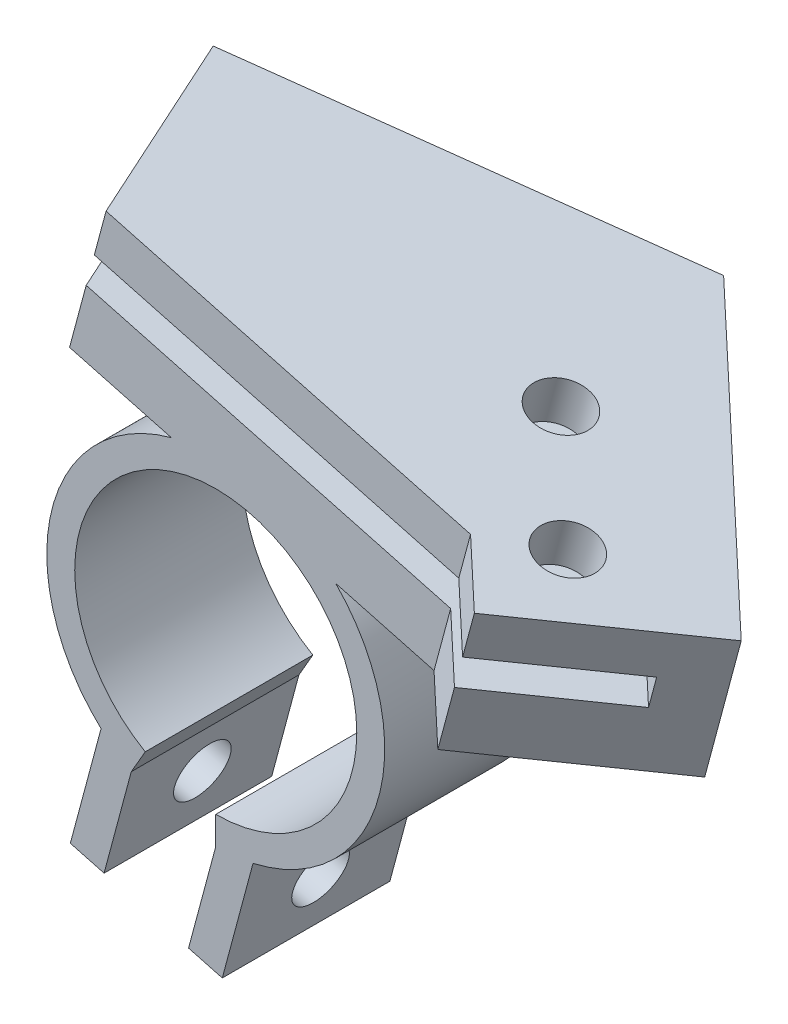
ISO-10303-21;
HEADER;
FILE_DESCRIPTION(('STEP AP214'),'2;1');
FILE_NAME('part.step','',(''),(''),'','','');
FILE_SCHEMA(('AUTOMOTIVE_DESIGN { 1 0 10303 214 1 1 1 1 }'));
ENDSEC;
DATA;
#1=APPLICATION_CONTEXT('core data for automotive mechanical design processes');
#2=APPLICATION_PROTOCOL_DEFINITION('international standard','automotive_design',2000,#1);
#3=PRODUCT_CONTEXT('',#1,'mechanical');
#4=PRODUCT('Part','Part','',(#3));
#5=PRODUCT_RELATED_PRODUCT_CATEGORY('part','',(#4));
#6=PRODUCT_DEFINITION_FORMATION('','',#4);
#7=PRODUCT_DEFINITION_CONTEXT('part definition',#1,'design');
#8=PRODUCT_DEFINITION('design','',#6,#7);
#9=PRODUCT_DEFINITION_SHAPE('','',#8);
#10=(LENGTH_UNIT() NAMED_UNIT(*) SI_UNIT(.MILLI.,.METRE.));
#11=(NAMED_UNIT(*) PLANE_ANGLE_UNIT() SI_UNIT($,.RADIAN.));
#12=(NAMED_UNIT(*) SI_UNIT($,.STERADIAN.) SOLID_ANGLE_UNIT());
#13=UNCERTAINTY_MEASURE_WITH_UNIT(LENGTH_MEASURE(1.E-05),#10,'distance_accuracy_value','');
#14=(GEOMETRIC_REPRESENTATION_CONTEXT(3) GLOBAL_UNCERTAINTY_ASSIGNED_CONTEXT((#13)) GLOBAL_UNIT_ASSIGNED_CONTEXT((#10,
#11,#12)) REPRESENTATION_CONTEXT('',''));
#15=CARTESIAN_POINT('',(0.,0.,0.));
#16=DIRECTION('',(0.,0.,1.));
#17=DIRECTION('',(1.,0.,0.));
#18=AXIS2_PLACEMENT_3D('',#15,#16,#17);
#19=CARTESIAN_POINT('',(0.,0.,0.));
#20=DIRECTION('',(0.,0.,-1.));
#21=DIRECTION('',(1.,0.,0.));
#22=AXIS2_PLACEMENT_3D('',#19,#20,#21);
#23=PLANE('',#22);
#24=DIRECTION('',(0.965925826289069,-0.258819045102519,0.));
#25=VECTOR('',#24,1.);
#26=CARTESIAN_POINT('',(8.95474809949023,33.4195748762786,0.));
#27=LINE('',#26,#25);
#28=CARTESIAN_POINT('',(-17.386622384415,40.4777238249699,0.));
#29=VERTEX_POINT('',#28);
#30=CARTESIAN_POINT('',(34.8002931997711,26.4942819387162,0.));
#31=VERTEX_POINT('',#30);
#32=EDGE_CURVE('E237',#29,#31,#27,.T.);
#33=ORIENTED_EDGE('',*,*,#32,.T.);
#34=DIRECTION('',(-0.258819045102519,-0.965925826289069,0.));
#35=VECTOR('',#34,1.);
#36=CARTESIAN_POINT('',(36.4826169929375,32.7727998095951,0.));
#37=LINE('',#36,#35);
#38=CARTESIAN_POINT('',(36.4826169929375,32.7727998095951,0.));
#39=VERTEX_POINT('',#38);
#40=EDGE_CURVE('E316',#39,#31,#37,.T.);
#41=ORIENTED_EDGE('',*,*,#40,.F.);
#42=DIRECTION('',(0.965925826289069,-0.258819045102519,0.));
#43=VECTOR('',#42,1.);
#44=CARTESIAN_POINT('',(10.6370718926566,39.6980927471575,0.));
#45=LINE('',#44,#43);
#46=CARTESIAN_POINT('',(-15.7042985912486,46.7562416958489,0.));
#47=VERTEX_POINT('',#46);
#48=EDGE_CURVE('E287',#47,#39,#45,.T.);
#49=ORIENTED_EDGE('',*,*,#48,.F.);
#50=DIRECTION('',(-0.258819045102519,-0.965925826289069,0.));
#51=VECTOR('',#50,1.);
#52=CARTESIAN_POINT('',(-15.7042985912486,46.7562416958489,0.));
#53=LINE('',#52,#51);
#54=EDGE_CURVE('E320',#47,#29,#53,.T.);
#55=ORIENTED_EDGE('',*,*,#54,.T.);
#56=EDGE_LOOP('',(#33,#41,#49,#55));
#57=FACE_BOUND('',#56,.T.);
#58=ADVANCED_FACE('F39',(#57),#23,.F.);
#59=CARTESIAN_POINT('',(-11.8964203484179,45.7359237958064,9.5898541144352));
#60=DIRECTION('',(0.893385391656228,-0.239381894224047,-0.380208956618535));
#61=DIRECTION('',(0.391594370746934,0.,0.920137950961329));
#62=AXIS2_PLACEMENT_3D('',#59,#60,#61);
#63=PLANE('',#62);
#64=DIRECTION('',(-0.367253650584263,0.098405319091434,-0.924900615908026));
#65=VECTOR('',#64,1.);
#66=CARTESIAN_POINT('',(-13.5787441415843,39.4574059249274,9.5898541144352));
#67=LINE('',#66,#65);
#68=CARTESIAN_POINT('',(-24.7316953961002,42.4458302067986,-18.4980123181606));
#69=VERTEX_POINT('',#68);
#70=EDGE_CURVE('E235',#29,#69,#67,.T.);
#71=ORIENTED_EDGE('',*,*,#70,.F.);
#72=ORIENTED_EDGE('',*,*,#54,.F.);
#73=DIRECTION('',(-0.367253650584263,0.098405319091434,-0.924900615908026));
#74=VECTOR('',#73,1.);
#75=CARTESIAN_POINT('',(-11.8964203484179,45.7359237958064,9.5898541144352));
#76=LINE('',#75,#74);
#77=CARTESIAN_POINT('',(-25.8037739823159,49.4623879708633,-25.4347669374709));
#78=VERTEX_POINT('',#77);
#79=EDGE_CURVE('E284',#47,#78,#76,.T.);
#80=ORIENTED_EDGE('',*,*,#79,.T.);
#81=DIRECTION('',(-0.258819045102519,-0.965925826289069,0.));
#82=VECTOR('',#81,1.);
#83=CARTESIAN_POINT('',(-25.8037739823159,49.4623879708633,-25.4347669374709));
#84=LINE('',#83,#82);
#85=CARTESIAN_POINT('',(-31.0319186933868,29.9506862798241,-25.4347669374709));
#86=VERTEX_POINT('',#85);
#87=EDGE_CURVE('E306',#78,#86,#84,.T.);
#88=ORIENTED_EDGE('',*,*,#87,.T.);
#89=DIRECTION('',(-0.367253650584263,0.098405319091434,-0.924900615908026));
#90=VECTOR('',#89,1.);
#91=CARTESIAN_POINT('',(-17.1245650594888,26.2242221047672,9.58985411443521));
#92=LINE('',#91,#90);
#93=CARTESIAN_POINT('',(-20.9324433023195,27.2445400048097,0.));
#94=VERTEX_POINT('',#93);
#95=EDGE_CURVE('E261',#94,#86,#92,.T.);
#96=ORIENTED_EDGE('',*,*,#95,.F.);
#97=CARTESIAN_POINT('',(-18.5513080873763,36.1310576066691,0.));
#98=VERTEX_POINT('',#97);
#99=EDGE_CURVE('E305',#98,#94,#53,.T.);
#100=ORIENTED_EDGE('',*,*,#99,.F.);
#101=DIRECTION('',(-0.367253650584263,0.098405319091434,-0.924900615908026));
#102=VECTOR('',#101,1.);
#103=CARTESIAN_POINT('',(-14.7434298445456,35.1107397066266,9.5898541144352));
#104=LINE('',#103,#102);
#105=CARTESIAN_POINT('',(-25.8963810990616,38.0991639884978,-18.4980123181606));
#106=VERTEX_POINT('',#105);
#107=EDGE_CURVE('E252',#98,#106,#104,.T.);
#108=ORIENTED_EDGE('',*,*,#107,.T.);
#109=DIRECTION('',(-0.258819045102519,-0.965925826289069,0.));
#110=VECTOR('',#109,1.);
#111=CARTESIAN_POINT('',(-24.7316953961002,42.4458302067986,-18.4980123181606));
#112=LINE('',#111,#110);
#113=EDGE_CURVE('E258',#69,#106,#112,.T.);
#114=ORIENTED_EDGE('',*,*,#113,.F.);
#115=EDGE_LOOP('',(#71,#72,#80,#88,#96,#100,#108,#114));
#116=FACE_BOUND('',#115,.T.);
#117=ADVANCED_FACE('F464',(#116),#63,.F.);
#118=CARTESIAN_POINT('',(32.852385511905,33.7455174032758,20.691346675466));
#119=DIRECTION('',(-0.718087161401695,0.19241087499274,-0.668826497542213));
#120=DIRECTION('',(0.681561853761521,0.,-0.731760506926384));
#121=AXIS2_PLACEMENT_3D('',#118,#119,#120);
#122=PLANE('',#121);
#123=DIRECTION('',(-0.646036787282486,0.173105035433139,0.743418533657465));
#124=VECTOR('',#123,1.);
#125=CARTESIAN_POINT('',(31.1700617187387,27.4669995323969,20.691346675466));
#126=LINE('',#125,#124);
#127=CARTESIAN_POINT('',(55.6522563056765,20.9070152638853,-7.48122423508143));
#128=VERTEX_POINT('',#127);
#129=CARTESIAN_POINT('',(42.7315205600268,24.369115972548,7.38714643806784));
#130=VERTEX_POINT('',#129);
#131=EDGE_CURVE('E206',#128,#130,#126,.T.);
#132=ORIENTED_EDGE('',*,*,#131,.F.);
#133=DIRECTION('',(-0.258819045102519,-0.965925826289069,0.));
#134=VECTOR('',#133,1.);
#135=CARTESIAN_POINT('',(55.6522563056765,20.9070152638853,-7.48122423508143));
#136=LINE('',#135,#134);
#137=CARTESIAN_POINT('',(54.4875706027152,16.5603490455845,-7.48122423508142));
#138=VERTEX_POINT('',#137);
#139=EDGE_CURVE('E214',#128,#138,#136,.T.);
#140=ORIENTED_EDGE('',*,*,#139,.T.);
#141=DIRECTION('',(-0.646036787282486,0.173105035433139,0.743418533657465));
#142=VECTOR('',#141,1.);
#143=CARTESIAN_POINT('',(30.0053760157773,23.1203333140961,20.691346675466));
#144=LINE('',#143,#142);
#145=CARTESIAN_POINT('',(41.5668348570655,20.0224497542472,7.38714643806785));
#146=VERTEX_POINT('',#145);
#147=EDGE_CURVE('E247',#138,#146,#144,.T.);
#148=ORIENTED_EDGE('',*,*,#147,.T.);
#149=DIRECTION('',(-0.258819045102519,-0.965925826289069,0.));
#150=VECTOR('',#149,1.);
#151=CARTESIAN_POINT('',(44.4138443531932,30.647633843427,7.38714643806784));
#152=LINE('',#151,#150);
#153=CARTESIAN_POINT('',(39.1856996421223,11.1359321523878,7.38714643806785));
#154=VERTEX_POINT('',#153);
#155=EDGE_CURVE('E315',#146,#154,#152,.T.);
#156=ORIENTED_EDGE('',*,*,#155,.T.);
#157=DIRECTION('',(-0.646036787282486,0.173105035433139,0.743418533657465));
#158=VECTOR('',#157,1.);
#159=CARTESIAN_POINT('',(27.6242408008341,14.2338157122366,20.691346675466));
#160=LINE('',#159,#158);
#161=CARTESIAN_POINT('',(56.9517112923908,6.37554367797645,-13.0568632375122));
#162=VERTEX_POINT('',#161);
#163=EDGE_CURVE('E270',#162,#154,#160,.T.);
#164=ORIENTED_EDGE('',*,*,#163,.F.);
#165=DIRECTION('',(-0.258819045102519,-0.965925826289069,0.));
#166=VECTOR('',#165,1.);
#167=CARTESIAN_POINT('',(62.1798560034617,25.8872453690156,-13.0568632375122));
#168=LINE('',#167,#166);
#169=CARTESIAN_POINT('',(62.1798560034617,25.8872453690156,-13.0568632375122));
#170=VERTEX_POINT('',#169);
#171=EDGE_CURVE('E311',#170,#162,#168,.T.);
#172=ORIENTED_EDGE('',*,*,#171,.F.);
#173=DIRECTION('',(-0.646036787282486,0.173105035433139,0.743418533657465));
#174=VECTOR('',#173,1.);
#175=CARTESIAN_POINT('',(32.852385511905,33.7455174032758,20.691346675466));
#176=LINE('',#175,#174);
#177=CARTESIAN_POINT('',(44.4138443531932,30.647633843427,7.38714643806784));
#178=VERTEX_POINT('',#177);
#179=EDGE_CURVE('E292',#170,#178,#176,.T.);
#180=ORIENTED_EDGE('',*,*,#179,.T.);
#181=EDGE_CURVE('E226',#178,#130,#152,.T.);
#182=ORIENTED_EDGE('',*,*,#181,.T.);
#183=EDGE_LOOP('',(#132,#140,#148,#156,#164,#172,#180,#182));
#184=FACE_BOUND('',#183,.T.);
#185=ADVANCED_FACE('F223',(#184),#122,.F.);
#186=CARTESIAN_POINT('',(22.1985307339448,36.6002091873087,-13.3042002373981));
#187=DIRECTION('',(-0.646036787282486,0.173105035433139,0.743418533657465));
#188=DIRECTION('',(-0.754813677044907,0.,-0.655939260104125));
#189=AXIS2_PLACEMENT_3D('',#186,#187,#188);
#190=PLANE('',#189);
#191=ORIENTED_EDGE('',*,*,#181,.F.);
#192=DIRECTION('',(0.718087161401695,-0.19241087499274,0.668826497542213));
#193=VECTOR('',#192,1.);
#194=CARTESIAN_POINT('',(22.1985307339448,36.6002091873087,-13.3042002373981));
#195=LINE('',#194,#193);
#196=EDGE_CURVE('E290',#39,#178,#195,.T.);
#197=ORIENTED_EDGE('',*,*,#196,.F.);
#198=ORIENTED_EDGE('',*,*,#40,.T.);
#199=DIRECTION('',(0.718087161401695,-0.19241087499274,0.668826497542213));
#200=VECTOR('',#199,1.);
#201=CARTESIAN_POINT('',(20.5162069407784,30.3216913164297,-13.3042002373981));
#202=LINE('',#201,#200);
#203=EDGE_CURVE('E220',#31,#130,#202,.T.);
#204=ORIENTED_EDGE('',*,*,#203,.T.);
#205=EDGE_LOOP('',(#191,#197,#198,#204));
#206=FACE_BOUND('',#205,.T.);
#207=ADVANCED_FACE('F618',(#206),#190,.T.);
#208=CARTESIAN_POINT('',(29.0892210288191,34.7538542875041,-20.3375832009133));
#209=DIRECTION('',(-0.258819045102519,-0.965925826289069,0.));
#210=DIRECTION('',(0.965925826289069,-0.258819045102519,0.));
#211=AXIS2_PLACEMENT_3D('',#208,#209,#210);
#212=CYLINDRICAL_SURFACE('',#211,4.);
#213=CARTESIAN_POINT('',(29.0892210288191,34.7538542875041,-20.3375832009133));
#214=DIRECTION('',(0.258819045102519,0.965925826289069,0.));
#215=DIRECTION('',(0.965925826289069,-0.258819045102519,0.));
#216=AXIS2_PLACEMENT_3D('',#213,#214,#215);
#217=CIRCLE('',#216,4.);
#218=CARTESIAN_POINT('',(32.9529243339754,33.718578107094,-20.3375832009133));
#219=VERTEX_POINT('',#218);
#220=EDGE_CURVE('E299',#219,#219,#217,.T.);
#221=ORIENTED_EDGE('',*,*,#220,.T.);
#222=EDGE_LOOP('',(#221));
#223=FACE_BOUND('',#222,.T.);
#224=CARTESIAN_POINT('',(27.4068972356528,28.4753364166251,-20.3375832009133));
#225=DIRECTION('',(0.258819045102519,0.965925826289069,0.));
#226=DIRECTION('',(0.965925826289069,-0.258819045102519,0.));
#227=AXIS2_PLACEMENT_3D('',#224,#225,#226);
#228=CIRCLE('',#227,4.);
#229=CARTESIAN_POINT('',(31.270600540809,27.4400602362151,-20.3375832009133));
#230=VERTEX_POINT('',#229);
#231=EDGE_CURVE('E230',#230,#230,#228,.T.);
#232=ORIENTED_EDGE('',*,*,#231,.F.);
#233=EDGE_LOOP('',(#232));
#234=FACE_BOUND('',#233,.T.);
#235=ADVANCED_FACE('F629',(#223,#234),#212,.F.);
#236=CARTESIAN_POINT('',(43.4509642568531,30.9056367876493,-6.96105325006903));
#237=DIRECTION('',(-0.258819045102519,-0.965925826289069,0.));
#238=DIRECTION('',(0.965925826289069,-0.258819045102519,0.));
#239=AXIS2_PLACEMENT_3D('',#236,#237,#238);
#240=CYLINDRICAL_SURFACE('',#239,4.00000000000001);
#241=CARTESIAN_POINT('',(43.4509642568531,30.9056367876493,-6.96105325006903));
#242=DIRECTION('',(0.258819045102519,0.965925826289069,0.));
#243=DIRECTION('',(0.965925826289069,-0.258819045102519,0.));
#244=AXIS2_PLACEMENT_3D('',#241,#242,#243);
#245=CIRCLE('',#244,4.00000000000001);
#246=CARTESIAN_POINT('',(47.3146675620093,29.8703606072392,-6.96105325006903));
#247=VERTEX_POINT('',#246);
#248=EDGE_CURVE('E302',#247,#247,#245,.T.);
#249=ORIENTED_EDGE('',*,*,#248,.T.);
#250=EDGE_LOOP('',(#249));
#251=FACE_BOUND('',#250,.T.);
#252=CARTESIAN_POINT('',(41.7686404636867,24.6271189167704,-6.96105325006903));
#253=DIRECTION('',(0.258819045102519,0.965925826289069,0.));
#254=DIRECTION('',(0.965925826289069,-0.258819045102519,0.));
#255=AXIS2_PLACEMENT_3D('',#252,#253,#254);
#256=CIRCLE('',#255,4.00000000000001);
#257=CARTESIAN_POINT('',(45.632343768843,23.5918427363603,-6.96105325006903));
#258=VERTEX_POINT('',#257);
#259=EDGE_CURVE('E227',#258,#258,#256,.T.);
#260=ORIENTED_EDGE('',*,*,#259,.F.);
#261=EDGE_LOOP('',(#260));
#262=FACE_BOUND('',#261,.T.);
#263=ADVANCED_FACE('F640',(#251,#262),#240,.F.);
#264=CARTESIAN_POINT('',(0.,0.,-24.));
#265=DIRECTION('',(0.,0.,1.));
#266=DIRECTION('',(-1.,0.,0.));
#267=AXIS2_PLACEMENT_3D('',#264,#265,#266);
#268=CYLINDRICAL_SURFACE('',#267,24.193);
#269=CARTESIAN_POINT('',(0.,0.,-24.));
#270=DIRECTION('',(0.,0.,1.));
#271=DIRECTION('',(1.,0.,0.));
#272=AXIS2_PLACEMENT_3D('',#269,#270,#271);
#273=CIRCLE('',#272,24.193);
#274=CARTESIAN_POINT('',(-6.36405527316415,23.3409521973743,-24.));
#275=VERTEX_POINT('',#274);
#276=CARTESIAN_POINT('',(-16.419734670584,-17.7677675116381,-24.));
#277=VERTEX_POINT('',#276);
#278=EDGE_CURVE('E411',#275,#277,#273,.T.);
#279=ORIENTED_EDGE('',*,*,#278,.T.);
#280=DIRECTION('',(0.,0.,-1.));
#281=VECTOR('',#280,1.);
#282=CARTESIAN_POINT('',(-16.419734670584,-17.7677675116381,0.));
#283=LINE('',#282,#281);
#284=CARTESIAN_POINT('',(-16.419734670584,-17.7677675116381,0.));
#285=VERTEX_POINT('',#284);
#286=EDGE_CURVE('E379',#285,#277,#283,.T.);
#287=ORIENTED_EDGE('',*,*,#286,.F.);
#288=CARTESIAN_POINT('',(0.,0.,0.));
#289=DIRECTION('',(0.,0.,1.));
#290=DIRECTION('',(1.,0.,0.));
#291=AXIS2_PLACEMENT_3D('',#288,#289,#290);
#292=CIRCLE('',#291,24.193);
#293=CARTESIAN_POINT('',(-6.36405527316413,23.3409521973743,0.));
#294=VERTEX_POINT('',#293);
#295=EDGE_CURVE('E405',#294,#285,#292,.T.);
#296=ORIENTED_EDGE('',*,*,#295,.F.);
#297=DIRECTION('',(0.,0.,1.));
#298=VECTOR('',#297,1.);
#299=CARTESIAN_POINT('',(-6.36405527316415,23.3409521973743,-24.));
#300=LINE('',#299,#298);
#301=EDGE_CURVE('E326',#275,#294,#300,.T.);
#302=ORIENTED_EDGE('',*,*,#301,.F.);
#303=EDGE_LOOP('',(#279,#287,#296,#302));
#304=FACE_BOUND('',#303,.T.);
#305=ADVANCED_FACE('F471',(#304),#268,.T.);
#306=CARTESIAN_POINT('',(5.3360235923067,-23.5972053689064,0.));
#307=VERTEX_POINT('',#306);
#308=CARTESIAN_POINT('',(17.1819096363356,17.0318299148623,0.));
#309=VERTEX_POINT('',#308);
#310=EDGE_CURVE('E412',#307,#309,#292,.T.);
#311=ORIENTED_EDGE('',*,*,#310,.F.);
#312=DIRECTION('',(0.,0.,-1.));
#313=VECTOR('',#312,1.);
#314=CARTESIAN_POINT('',(5.3360235923067,-23.5972053689064,0.));
#315=LINE('',#314,#313);
#316=CARTESIAN_POINT('',(5.3360235923067,-23.5972053689064,-24.));
#317=VERTEX_POINT('',#316);
#318=EDGE_CURVE('E356',#307,#317,#315,.T.);
#319=ORIENTED_EDGE('',*,*,#318,.T.);
#320=CARTESIAN_POINT('',(17.1819096363356,17.0318299148623,-24.));
#321=VERTEX_POINT('',#320);
#322=EDGE_CURVE('E408',#317,#321,#273,.T.);
#323=ORIENTED_EDGE('',*,*,#322,.T.);
#324=DIRECTION('',(0.,0.,1.));
#325=VECTOR('',#324,1.);
#326=CARTESIAN_POINT('',(17.1819096363356,17.0318299148623,-24.));
#327=LINE('',#326,#325);
#328=EDGE_CURVE('E324',#309,#321,#327,.F.);
#329=ORIENTED_EDGE('',*,*,#328,.F.);
#330=EDGE_LOOP('',(#311,#319,#323,#329));
#331=FACE_BOUND('',#330,.T.);
#332=ADVANCED_FACE('F41',(#331),#268,.T.);
#333=CARTESIAN_POINT('',(0.,0.,-24.));
#334=DIRECTION('',(0.,0.,-1.));
#335=DIRECTION('',(1.,0.,0.));
#336=AXIS2_PLACEMENT_3D('',#333,#334,#335);
#337=PLANE('',#336);
#338=DIRECTION('',(0.965925826289069,-0.258819045102519,0.));
#339=VECTOR('',#338,1.);
#340=CARTESIAN_POINT('',(5.40892718158571,20.1863910561183,-24.));
#341=LINE('',#340,#339);
#342=EDGE_CURVE('E63',#275,#321,#341,.T.);
#343=ORIENTED_EDGE('',*,*,#342,.T.);
#344=ORIENTED_EDGE('',*,*,#322,.F.);
#345=DIRECTION('',(-0.258819045102521,-0.965925826289068,0.));
#346=VECTOR('',#345,1.);
#347=CARTESIAN_POINT('',(10.8778791314454,-2.91471892863415,-24.));
#348=LINE('',#347,#346);
#349=CARTESIAN_POINT('',(0.93609982556388,-40.0179444158206,-24.));
#350=VERTEX_POINT('',#349);
#351=EDGE_CURVE('E342',#317,#350,#348,.T.);
#352=ORIENTED_EDGE('',*,*,#351,.T.);
#353=DIRECTION('',(-0.965925826289068,0.258819045102521,0.));
#354=VECTOR('',#353,1.);
#355=CARTESIAN_POINT('',(-9.94177930588146,-37.1032254871864,-24.));
#356=LINE('',#355,#354);
#357=CARTESIAN_POINT('',(-3.89352930588146,-38.723849190308,-24.));
#358=VERTEX_POINT('',#357);
#359=EDGE_CURVE('E351',#350,#358,#356,.T.);
#360=ORIENTED_EDGE('',*,*,#359,.T.);
#361=DIRECTION('',(0.258819045102521,0.965925826289068,0.));
#362=VECTOR('',#361,1.);
#363=CARTESIAN_POINT('',(6.04825000000001,-1.62062370312154,-24.));
#364=LINE('',#363,#362);
#365=CARTESIAN_POINT('',(0.,-24.193,-24.));
#366=VERTEX_POINT('',#365);
#367=EDGE_CURVE('E337',#358,#366,#364,.T.);
#368=ORIENTED_EDGE('',*,*,#367,.T.);
#369=DIRECTION('',(0.,1.,0.));
#370=VECTOR('',#369,1.);
#371=CARTESIAN_POINT('',(0.,-24.193,-24.));
#372=LINE('',#371,#370);
#373=CARTESIAN_POINT('',(0.,-20.193,-24.));
#374=VERTEX_POINT('',#373);
#375=EDGE_CURVE('E382',#366,#374,#372,.T.);
#376=ORIENTED_EDGE('',*,*,#375,.T.);
#377=CARTESIAN_POINT('',(0.,0.,-24.));
#378=DIRECTION('',(0.,0.,1.));
#379=DIRECTION('',(1.,0.,0.));
#380=AXIS2_PLACEMENT_3D('',#377,#378,#379);
#381=CIRCLE('',#380,20.193);
#382=CARTESIAN_POINT('',(-10.0965,-17.4876509786192,-24.));
#383=VERTEX_POINT('',#382);
#384=EDGE_CURVE('E402',#374,#383,#381,.T.);
#385=ORIENTED_EDGE('',*,*,#384,.T.);
#386=DIRECTION('',(-0.500000000000001,-0.866025403784438,0.));
#387=VECTOR('',#386,1.);
#388=CARTESIAN_POINT('',(-12.0965,-20.9517525937569,-24.));
#389=LINE('',#388,#387);
#390=CARTESIAN_POINT('',(-12.0965,-20.9517525937569,-24.));
#391=VERTEX_POINT('',#390);
#392=EDGE_CURVE('E390',#383,#391,#389,.T.);
#393=ORIENTED_EDGE('',*,*,#392,.T.);
#394=DIRECTION('',(-0.258819045102521,-0.965925826289068,0.));
#395=VECTOR('',#394,1.);
#396=CARTESIAN_POINT('',(-6.04825000000001,1.62062370312154,-24.));
#397=LINE('',#396,#395);
#398=CARTESIAN_POINT('',(-15.9900293058815,-35.4826017840649,-24.));
#399=VERTEX_POINT('',#398);
#400=EDGE_CURVE('E366',#391,#399,#397,.T.);
#401=ORIENTED_EDGE('',*,*,#400,.T.);
#402=DIRECTION('',(-0.965925826289068,0.258819045102521,0.));
#403=VECTOR('',#402,1.);
#404=CARTESIAN_POINT('',(-9.94177930588146,-37.1032254871864,-24.));
#405=LINE('',#404,#403);
#406=CARTESIAN_POINT('',(-20.8196584373268,-34.1885065585523,-24.));
#407=VERTEX_POINT('',#406);
#408=EDGE_CURVE('E374',#399,#407,#405,.T.);
#409=ORIENTED_EDGE('',*,*,#408,.T.);
#410=DIRECTION('',(0.258819045102521,0.965925826289068,0.));
#411=VECTOR('',#410,1.);
#412=CARTESIAN_POINT('',(-10.8778791314454,2.91471892863415,-24.));
#413=LINE('',#412,#411);
#414=EDGE_CURVE('E359',#407,#277,#413,.T.);
#415=ORIENTED_EDGE('',*,*,#414,.T.);
#416=ORIENTED_EDGE('',*,*,#278,.F.);
#417=EDGE_LOOP('',(#343,#344,#352,#360,#368,#376,#385,#393,#401,#409,#415,#416));
#418=FACE_BOUND('',#417,.T.);
#419=ADVANCED_FACE('F435',(#418),#337,.T.);
#420=ORIENTED_EDGE('',*,*,#99,.T.);
#421=DIRECTION('',(0.965925826289069,-0.258819045102519,0.));
#422=VECTOR('',#421,1.);
#423=CARTESIAN_POINT('',(5.40892718158571,20.1863910561183,0.));
#424=LINE('',#423,#422);
#425=EDGE_CURVE('E266',#94,#294,#424,.T.);
#426=ORIENTED_EDGE('',*,*,#425,.T.);
#427=ORIENTED_EDGE('',*,*,#295,.T.);
#428=DIRECTION('',(0.258819045102521,0.965925826289068,0.));
#429=VECTOR('',#428,1.);
#430=CARTESIAN_POINT('',(-10.8778791314454,2.91471892863415,0.));
#431=LINE('',#430,#429);
#432=CARTESIAN_POINT('',(-20.8196584373268,-34.1885065585523,0.));
#433=VERTEX_POINT('',#432);
#434=EDGE_CURVE('E363',#433,#285,#431,.T.);
#435=ORIENTED_EDGE('',*,*,#434,.F.);
#436=DIRECTION('',(-0.965925826289068,0.258819045102521,0.));
#437=VECTOR('',#436,1.);
#438=CARTESIAN_POINT('',(-9.94177930588146,-37.1032254871864,0.));
#439=LINE('',#438,#437);
#440=CARTESIAN_POINT('',(-15.9900293058815,-35.4826017840649,0.));
#441=VERTEX_POINT('',#440);
#442=EDGE_CURVE('E365',#441,#433,#439,.T.);
#443=ORIENTED_EDGE('',*,*,#442,.F.);
#444=DIRECTION('',(-0.258819045102521,-0.965925826289068,0.));
#445=VECTOR('',#444,1.);
#446=CARTESIAN_POINT('',(-6.04825000000001,1.62062370312154,0.));
#447=LINE('',#446,#445);
#448=CARTESIAN_POINT('',(-12.0965,-20.9517525937569,0.));
#449=VERTEX_POINT('',#448);
#450=EDGE_CURVE('E369',#449,#441,#447,.T.);
#451=ORIENTED_EDGE('',*,*,#450,.F.);
#452=DIRECTION('',(-0.500000000000001,-0.866025403784438,0.));
#453=VECTOR('',#452,1.);
#454=CARTESIAN_POINT('',(-12.0965,-20.9517525937569,0.));
#455=LINE('',#454,#453);
#456=CARTESIAN_POINT('',(-10.0965,-17.4876509786192,0.));
#457=VERTEX_POINT('',#456);
#458=EDGE_CURVE('E389',#457,#449,#455,.T.);
#459=ORIENTED_EDGE('',*,*,#458,.F.);
#460=CARTESIAN_POINT('',(0.,0.,0.));
#461=DIRECTION('',(0.,0.,1.));
#462=DIRECTION('',(1.,0.,0.));
#463=AXIS2_PLACEMENT_3D('',#460,#461,#462);
#464=CIRCLE('',#463,20.193);
#465=CARTESIAN_POINT('',(0.,-20.193,0.));
#466=VERTEX_POINT('',#465);
#467=EDGE_CURVE('E400',#466,#457,#464,.T.);
#468=ORIENTED_EDGE('',*,*,#467,.F.);
#469=DIRECTION('',(0.,1.,0.));
#470=VECTOR('',#469,1.);
#471=CARTESIAN_POINT('',(0.,-24.193,0.));
#472=LINE('',#471,#470);
#473=CARTESIAN_POINT('',(0.,-24.193,0.));
#474=VERTEX_POINT('',#473);
#475=EDGE_CURVE('E386',#474,#466,#472,.T.);
#476=ORIENTED_EDGE('',*,*,#475,.F.);
#477=DIRECTION('',(0.258819045102521,0.965925826289068,0.));
#478=VECTOR('',#477,1.);
#479=CARTESIAN_POINT('',(6.04825000000001,-1.62062370312154,0.));
#480=LINE('',#479,#478);
#481=CARTESIAN_POINT('',(-3.89352930588146,-38.723849190308,0.));
#482=VERTEX_POINT('',#481);
#483=EDGE_CURVE('E338',#482,#474,#480,.T.);
#484=ORIENTED_EDGE('',*,*,#483,.F.);
#485=DIRECTION('',(-0.965925826289068,0.258819045102521,0.));
#486=VECTOR('',#485,1.);
#487=CARTESIAN_POINT('',(-9.94177930588146,-37.1032254871864,0.));
#488=LINE('',#487,#486);
#489=CARTESIAN_POINT('',(0.93609982556388,-40.0179444158206,0.));
#490=VERTEX_POINT('',#489);
#491=EDGE_CURVE('E341',#490,#482,#488,.T.);
#492=ORIENTED_EDGE('',*,*,#491,.F.);
#493=DIRECTION('',(-0.258819045102521,-0.965925826289068,0.));
#494=VECTOR('',#493,1.);
#495=CARTESIAN_POINT('',(10.8778791314454,-2.91471892863415,0.));
#496=LINE('',#495,#494);
#497=EDGE_CURVE('E345',#307,#490,#496,.T.);
#498=ORIENTED_EDGE('',*,*,#497,.F.);
#499=ORIENTED_EDGE('',*,*,#310,.T.);
#500=CARTESIAN_POINT('',(31.2544722818666,13.2610981185559,0.));
#501=VERTEX_POINT('',#500);
#502=EDGE_CURVE('E265',#309,#501,#424,.T.);
#503=ORIENTED_EDGE('',*,*,#502,.T.);
#504=CARTESIAN_POINT('',(33.6356074968098,22.1476157204154,0.));
#505=VERTEX_POINT('',#504);
#506=EDGE_CURVE('E319',#505,#501,#37,.T.);
#507=ORIENTED_EDGE('',*,*,#506,.F.);
#508=DIRECTION('',(0.965925826289069,-0.258819045102519,0.));
#509=VECTOR('',#508,1.);
#510=CARTESIAN_POINT('',(7.79006239652889,29.0729086579777,0.));
#511=LINE('',#510,#509);
#512=EDGE_CURVE('E255',#98,#505,#511,.T.);
#513=ORIENTED_EDGE('',*,*,#512,.F.);
#514=EDGE_LOOP('',(#420,#426,#427,#435,#443,#451,#459,#468,#476,#484,#492,#498,#499,#503,#507,#513));
#515=FACE_BOUND('',#514,.T.);
#516=ADVANCED_FACE('F427',(#515),#23,.F.);
#517=CARTESIAN_POINT('',(0.,0.,-24.));
#518=DIRECTION('',(0.,0.,1.));
#519=DIRECTION('',(-1.,0.,0.));
#520=AXIS2_PLACEMENT_3D('',#517,#518,#519);
#521=CYLINDRICAL_SURFACE('',#520,20.193);
#522=DIRECTION('',(0.,0.,1.));
#523=VECTOR('',#522,1.);
#524=CARTESIAN_POINT('',(-10.0965,-17.4876509786192,-24.));
#525=LINE('',#524,#523);
#526=EDGE_CURVE('E11',#457,#383,#525,.F.);
#527=ORIENTED_EDGE('',*,*,#526,.T.);
#528=ORIENTED_EDGE('',*,*,#384,.F.);
#529=DIRECTION('',(0.,0.,1.));
#530=VECTOR('',#529,1.);
#531=CARTESIAN_POINT('',(0.,-20.193,-24.));
#532=LINE('',#531,#530);
#533=EDGE_CURVE('E48',#374,#466,#532,.T.);
#534=ORIENTED_EDGE('',*,*,#533,.T.);
#535=ORIENTED_EDGE('',*,*,#467,.T.);
#536=EDGE_LOOP('',(#527,#528,#534,#535));
#537=FACE_BOUND('',#536,.T.);
#538=ADVANCED_FACE('F417',(#537),#521,.F.);
#539=CARTESIAN_POINT('',(0.,-24.193,0.));
#540=DIRECTION('',(1.,0.,0.));
#541=DIRECTION('',(0.,0.,1.));
#542=AXIS2_PLACEMENT_3D('',#539,#540,#541);
#543=PLANE('',#542);
#544=ORIENTED_EDGE('',*,*,#533,.F.);
#545=ORIENTED_EDGE('',*,*,#375,.F.);
#546=DIRECTION('',(0.,0.,-1.));
#547=VECTOR('',#546,1.);
#548=CARTESIAN_POINT('',(0.,-24.193,0.));
#549=LINE('',#548,#547);
#550=EDGE_CURVE('E393',#474,#366,#549,.T.);
#551=ORIENTED_EDGE('',*,*,#550,.F.);
#552=ORIENTED_EDGE('',*,*,#475,.T.);
#553=EDGE_LOOP('',(#544,#545,#551,#552));
#554=FACE_BOUND('',#553,.T.);
#555=ADVANCED_FACE('F423',(#554),#543,.F.);
#556=CARTESIAN_POINT('',(-12.0965,-20.9517525937569,0.));
#557=DIRECTION('',(-0.866025403784438,0.500000000000001,0.));
#558=DIRECTION('',(-0.500000000000001,-0.866025403784438,0.));
#559=AXIS2_PLACEMENT_3D('',#556,#557,#558);
#560=PLANE('',#559);
#561=ORIENTED_EDGE('',*,*,#526,.F.);
#562=ORIENTED_EDGE('',*,*,#458,.T.);
#563=DIRECTION('',(0.,0.,-1.));
#564=VECTOR('',#563,1.);
#565=CARTESIAN_POINT('',(-12.0965,-20.9517525937569,0.));
#566=LINE('',#565,#564);
#567=EDGE_CURVE('E398',#449,#391,#566,.T.);
#568=ORIENTED_EDGE('',*,*,#567,.T.);
#569=ORIENTED_EDGE('',*,*,#392,.F.);
#570=EDGE_LOOP('',(#561,#562,#568,#569));
#571=FACE_BOUND('',#570,.T.);
#572=ADVANCED_FACE('F431',(#571),#560,.F.);
#573=CARTESIAN_POINT('',(-10.8778791314454,2.91471892863415,0.));
#574=DIRECTION('',(0.965925826289068,-0.258819045102521,0.));
#575=DIRECTION('',(0.258819045102521,0.965925826289068,0.));
#576=AXIS2_PLACEMENT_3D('',#573,#574,#575);
#577=PLANE('',#576);
#578=CARTESIAN_POINT('',(-18.7491060765067,-26.4610999482397,-12.));
#579=DIRECTION('',(0.965925826289068,-0.258819045102521,0.));
#580=DIRECTION('',(-0.258819045102521,-0.965925826289068,0.));
#581=AXIS2_PLACEMENT_3D('',#578,#579,#580);
#582=CIRCLE('',#581,4.);
#583=CARTESIAN_POINT('',(-19.7843822569167,-30.324803253396,-12.));
#584=VERTEX_POINT('',#583);
#585=EDGE_CURVE('E328',#584,#584,#582,.T.);
#586=ORIENTED_EDGE('',*,*,#585,.T.);
#587=EDGE_LOOP('',(#586));
#588=FACE_BOUND('',#587,.T.);
#589=ORIENTED_EDGE('',*,*,#414,.F.);
#590=DIRECTION('',(0.,0.,-1.));
#591=VECTOR('',#590,1.);
#592=CARTESIAN_POINT('',(-20.8196584373268,-34.1885065585523,0.));
#593=LINE('',#592,#591);
#594=EDGE_CURVE('E372',#433,#407,#593,.T.);
#595=ORIENTED_EDGE('',*,*,#594,.F.);
#596=ORIENTED_EDGE('',*,*,#434,.T.);
#597=ORIENTED_EDGE('',*,*,#286,.T.);
#598=EDGE_LOOP('',(#589,#595,#596,#597));
#599=FACE_BOUND('',#598,.T.);
#600=ADVANCED_FACE('F475',(#588,#599),#577,.F.);
#601=CARTESIAN_POINT('',(-6.04825000000001,1.62062370312154,0.));
#602=DIRECTION('',(-0.965925826289068,0.258819045102521,0.));
#603=DIRECTION('',(-0.258819045102521,-0.965925826289068,0.));
#604=AXIS2_PLACEMENT_3D('',#601,#602,#603);
#605=PLANE('',#604);
#606=CARTESIAN_POINT('',(-13.9194769450613,-27.7551951737523,-12.));
#607=DIRECTION('',(0.965925826289068,-0.258819045102521,0.));
#608=DIRECTION('',(-0.258819045102521,-0.965925826289068,0.));
#609=AXIS2_PLACEMENT_3D('',#606,#607,#608);
#610=CIRCLE('',#609,4.);
#611=CARTESIAN_POINT('',(-14.9547531254714,-31.6188984789086,-12.));
#612=VERTEX_POINT('',#611);
#613=EDGE_CURVE('E334',#612,#612,#610,.T.);
#614=ORIENTED_EDGE('',*,*,#613,.F.);
#615=EDGE_LOOP('',(#614));
#616=FACE_BOUND('',#615,.T.);
#617=ORIENTED_EDGE('',*,*,#400,.F.);
#618=ORIENTED_EDGE('',*,*,#567,.F.);
#619=ORIENTED_EDGE('',*,*,#450,.T.);
#620=DIRECTION('',(0.,0.,-1.));
#621=VECTOR('',#620,1.);
#622=CARTESIAN_POINT('',(-15.9900293058815,-35.4826017840649,0.));
#623=LINE('',#622,#621);
#624=EDGE_CURVE('E383',#441,#399,#623,.T.);
#625=ORIENTED_EDGE('',*,*,#624,.T.);
#626=EDGE_LOOP('',(#617,#618,#619,#625));
#627=FACE_BOUND('',#626,.T.);
#628=ADVANCED_FACE('F480',(#616,#627),#605,.F.);
#629=CARTESIAN_POINT('',(-9.94177930588146,-37.1032254871864,0.));
#630=DIRECTION('',(0.258819045102521,0.965925826289068,0.));
#631=DIRECTION('',(-0.965925826289068,0.258819045102521,0.));
#632=AXIS2_PLACEMENT_3D('',#629,#630,#631);
#633=PLANE('',#632);
#634=ORIENTED_EDGE('',*,*,#408,.F.);
#635=ORIENTED_EDGE('',*,*,#624,.F.);
#636=ORIENTED_EDGE('',*,*,#442,.T.);
#637=ORIENTED_EDGE('',*,*,#594,.T.);
#638=EDGE_LOOP('',(#634,#635,#636,#637));
#639=FACE_BOUND('',#638,.T.);
#640=ADVANCED_FACE('F478',(#639),#633,.F.);
#641=CARTESIAN_POINT('',(6.04825000000001,-1.62062370312154,0.));
#642=DIRECTION('',(0.965925826289068,-0.258819045102521,0.));
#643=DIRECTION('',(0.258819045102521,0.965925826289068,0.));
#644=AXIS2_PLACEMENT_3D('',#641,#642,#643);
#645=PLANE('',#644);
#646=CARTESIAN_POINT('',(-1.82297694506129,-30.9964425799954,-12.));
#647=DIRECTION('',(-0.965925826289068,0.258819045102521,0.));
#648=DIRECTION('',(0.258819045102521,0.965925826289068,0.));
#649=AXIS2_PLACEMENT_3D('',#646,#647,#648);
#650=CIRCLE('',#649,4.);
#651=CARTESIAN_POINT('',(-0.78770076465121,-27.1327392748392,-12.));
#652=VERTEX_POINT('',#651);
#653=EDGE_CURVE('E331',#652,#652,#650,.T.);
#654=ORIENTED_EDGE('',*,*,#653,.F.);
#655=EDGE_LOOP('',(#654));
#656=FACE_BOUND('',#655,.T.);
#657=ORIENTED_EDGE('',*,*,#367,.F.);
#658=DIRECTION('',(0.,0.,-1.));
#659=VECTOR('',#658,1.);
#660=CARTESIAN_POINT('',(-3.89352930588146,-38.723849190308,0.));
#661=LINE('',#660,#659);
#662=EDGE_CURVE('E348',#482,#358,#661,.T.);
#663=ORIENTED_EDGE('',*,*,#662,.F.);
#664=ORIENTED_EDGE('',*,*,#483,.T.);
#665=ORIENTED_EDGE('',*,*,#550,.T.);
#666=EDGE_LOOP('',(#657,#663,#664,#665));
#667=FACE_BOUND('',#666,.T.);
#668=ADVANCED_FACE('F439',(#656,#667),#645,.F.);
#669=CARTESIAN_POINT('',(10.8778791314454,-2.91471892863415,0.));
#670=DIRECTION('',(-0.965925826289068,0.258819045102521,0.));
#671=DIRECTION('',(-0.258819045102521,-0.965925826289068,0.));
#672=AXIS2_PLACEMENT_3D('',#669,#670,#671);
#673=PLANE('',#672);
#674=CARTESIAN_POINT('',(3.00665218638405,-32.290537805508,-12.));
#675=DIRECTION('',(0.965925826289068,-0.258819045102521,0.));
#676=DIRECTION('',(-0.258819045102521,-0.965925826289068,0.));
#677=AXIS2_PLACEMENT_3D('',#674,#675,#676);
#678=CIRCLE('',#677,4.);
#679=CARTESIAN_POINT('',(1.97137600597396,-36.1542411106643,-12.));
#680=VERTEX_POINT('',#679);
#681=EDGE_CURVE('E43',#680,#680,#678,.T.);
#682=ORIENTED_EDGE('',*,*,#681,.F.);
#683=EDGE_LOOP('',(#682));
#684=FACE_BOUND('',#683,.T.);
#685=ORIENTED_EDGE('',*,*,#351,.F.);
#686=ORIENTED_EDGE('',*,*,#318,.F.);
#687=ORIENTED_EDGE('',*,*,#497,.T.);
#688=DIRECTION('',(0.,0.,-1.));
#689=VECTOR('',#688,1.);
#690=CARTESIAN_POINT('',(0.93609982556388,-40.0179444158206,0.));
#691=LINE('',#690,#689);
#692=EDGE_CURVE('E360',#490,#350,#691,.T.);
#693=ORIENTED_EDGE('',*,*,#692,.T.);
#694=EDGE_LOOP('',(#685,#686,#687,#693));
#695=FACE_BOUND('',#694,.T.);
#696=ADVANCED_FACE('F445',(#684,#695),#673,.F.);
#697=CARTESIAN_POINT('',(-9.94177930588146,-37.1032254871864,0.));
#698=DIRECTION('',(0.258819045102521,0.965925826289068,0.));
#699=DIRECTION('',(-0.965925826289068,0.258819045102521,0.));
#700=AXIS2_PLACEMENT_3D('',#697,#698,#699);
#701=PLANE('',#700);
#702=ORIENTED_EDGE('',*,*,#359,.F.);
#703=ORIENTED_EDGE('',*,*,#692,.F.);
#704=ORIENTED_EDGE('',*,*,#491,.T.);
#705=ORIENTED_EDGE('',*,*,#662,.T.);
#706=EDGE_LOOP('',(#702,#703,#704,#705));
#707=FACE_BOUND('',#706,.T.);
#708=ADVANCED_FACE('F443',(#707),#701,.F.);
#709=CARTESIAN_POINT('',(4.43311375443099,-32.6727570307003,-12.));
#710=DIRECTION('',(-0.965925826289068,0.258819045102521,0.));
#711=DIRECTION('',(-0.258819045102521,-0.965925826289068,0.));
#712=AXIS2_PLACEMENT_3D('',#709,#710,#711);
#713=CYLINDRICAL_SURFACE('',#712,4.);
#714=ORIENTED_EDGE('',*,*,#681,.T.);
#715=EDGE_LOOP('',(#714));
#716=FACE_BOUND('',#715,.T.);
#717=ORIENTED_EDGE('',*,*,#653,.T.);
#718=EDGE_LOOP('',(#717));
#719=FACE_BOUND('',#718,.T.);
#720=ADVANCED_FACE('F557',(#716,#719),#713,.F.);
#721=ORIENTED_EDGE('',*,*,#585,.F.);
#722=EDGE_LOOP('',(#721));
#723=FACE_BOUND('',#722,.T.);
#724=ORIENTED_EDGE('',*,*,#613,.T.);
#725=EDGE_LOOP('',(#724));
#726=FACE_BOUND('',#725,.T.);
#727=ADVANCED_FACE('F566',(#723,#726),#713,.F.);
#728=CARTESIAN_POINT('',(5.40892718158571,20.1863910561183,0.));
#729=DIRECTION('',(-0.258819045102519,-0.965925826289069,0.));
#730=DIRECTION('',(0.965925826289069,-0.258819045102519,0.));
#731=AXIS2_PLACEMENT_3D('',#728,#729,#730);
#732=PLANE('',#731);
#733=CARTESIAN_POINT('',(38.2228195457822,11.3939350966101,-6.96105325006902));
#734=DIRECTION('',(0.258819045102519,0.965925826289069,0.));
#735=DIRECTION('',(0.965925826289069,-0.258819045102519,0.));
#736=AXIS2_PLACEMENT_3D('',#733,#734,#735);
#737=CIRCLE('',#736,4.00000000000001);
#738=CARTESIAN_POINT('',(42.0865228509384,10.3586589162001,-6.96105325006902));
#739=VERTEX_POINT('',#738);
#740=EDGE_CURVE('E281',#739,#739,#737,.T.);
#741=ORIENTED_EDGE('',*,*,#740,.T.);
#742=EDGE_LOOP('',(#741));
#743=FACE_BOUND('',#742,.T.);
#744=CARTESIAN_POINT('',(23.8610763177483,15.2421525964649,-20.3375832009133));
#745=DIRECTION('',(0.258819045102519,0.965925826289069,0.));
#746=DIRECTION('',(0.965925826289069,-0.258819045102519,0.));
#747=AXIS2_PLACEMENT_3D('',#744,#745,#746);
#748=CIRCLE('',#747,4.);
#749=CARTESIAN_POINT('',(27.7247796229045,14.2068764160548,-20.3375832009133));
#750=VERTEX_POINT('',#749);
#751=EDGE_CURVE('E278',#750,#750,#748,.T.);
#752=ORIENTED_EDGE('',*,*,#751,.T.);
#753=EDGE_LOOP('',(#752));
#754=FACE_BOUND('',#753,.T.);
#755=ORIENTED_EDGE('',*,*,#301,.T.);
#756=ORIENTED_EDGE('',*,*,#425,.F.);
#757=ORIENTED_EDGE('',*,*,#95,.T.);
#758=DIRECTION('',(0.893385391656228,-0.239381894224047,-0.380208956618535));
#759=VECTOR('',#758,1.);
#760=CARTESIAN_POINT('',(-8.49842645231221,23.9128552311753,-35.024621051906));
#761=LINE('',#760,#759);
#762=CARTESIAN_POINT('',(20.2362947680651,16.2134098854417,-47.2536080892585));
#763=VERTEX_POINT('',#762);
#764=EDGE_CURVE('E275',#86,#763,#761,.T.);
#765=ORIENTED_EDGE('',*,*,#764,.T.);
#766=DIRECTION('',(0.718087161401695,-0.19241087499274,0.668826497542213));
#767=VECTOR('',#766,1.);
#768=CARTESIAN_POINT('',(34.7363976731422,12.3281190218582,-33.7482099129784));
#769=LINE('',#768,#767);
#770=EDGE_CURVE('E273',#763,#162,#769,.T.);
#771=ORIENTED_EDGE('',*,*,#770,.T.);
#772=ORIENTED_EDGE('',*,*,#163,.T.);
#773=DIRECTION('',(0.718087161401695,-0.19241087499274,0.668826497542213));
#774=VECTOR('',#773,1.);
#775=CARTESIAN_POINT('',(16.9703860228739,17.0885074962695,-13.3042002373981));
#776=LINE('',#775,#774);
#777=EDGE_CURVE('E268',#501,#154,#776,.T.);
#778=ORIENTED_EDGE('',*,*,#777,.F.);
#779=ORIENTED_EDGE('',*,*,#502,.F.);
#780=ORIENTED_EDGE('',*,*,#328,.T.);
#781=ORIENTED_EDGE('',*,*,#342,.F.);
#782=EDGE_LOOP('',(#755,#756,#757,#765,#771,#772,#778,#779,#780,#781));
#783=FACE_BOUND('',#782,.T.);
#784=ADVANCED_FACE('F453',(#743,#754,#783),#732,.T.);
#785=CARTESIAN_POINT('',(-3.27028174124132,43.4245569222145,-35.024621051906));
#786=DIRECTION('',(0.367253650584263,-0.098405319091434,0.924900615908025));
#787=DIRECTION('',(-0.929411591317328,0.,0.369044839992366));
#788=AXIS2_PLACEMENT_3D('',#785,#786,#787);
#789=PLANE('',#788);
#790=ORIENTED_EDGE('',*,*,#87,.F.);
#791=DIRECTION('',(0.893385391656228,-0.239381894224047,-0.380208956618535));
#792=VECTOR('',#791,1.);
#793=CARTESIAN_POINT('',(-3.27028174124132,43.4245569222145,-35.024621051906));
#794=LINE('',#793,#792);
#795=CARTESIAN_POINT('',(25.464439479136,35.7251115764809,-47.2536080892585));
#796=VERTEX_POINT('',#795);
#797=EDGE_CURVE('E296',#78,#796,#794,.T.);
#798=ORIENTED_EDGE('',*,*,#797,.T.);
#799=DIRECTION('',(-0.258819045102519,-0.965925826289069,0.));
#800=VECTOR('',#799,1.);
#801=CARTESIAN_POINT('',(25.464439479136,35.7251115764809,-47.2536080892585));
#802=LINE('',#801,#800);
#803=EDGE_CURVE('E309',#796,#763,#802,.T.);
#804=ORIENTED_EDGE('',*,*,#803,.T.);
#805=ORIENTED_EDGE('',*,*,#764,.F.);
#806=EDGE_LOOP('',(#790,#798,#804,#805));
#807=FACE_BOUND('',#806,.T.);
#808=ADVANCED_FACE('F585',(#807),#789,.F.);
#809=CARTESIAN_POINT('',(39.9645423842131,31.8398207128974,-33.7482099129784));
#810=DIRECTION('',(-0.646036787282486,0.173105035433139,0.743418533657465));
#811=DIRECTION('',(-0.754813677044907,0.,-0.655939260104125));
#812=AXIS2_PLACEMENT_3D('',#809,#810,#811);
#813=PLANE('',#812);
#814=ORIENTED_EDGE('',*,*,#803,.F.);
#815=DIRECTION('',(0.718087161401695,-0.19241087499274,0.668826497542213));
#816=VECTOR('',#815,1.);
#817=CARTESIAN_POINT('',(39.9645423842131,31.8398207128974,-33.7482099129784));
#818=LINE('',#817,#816);
#819=EDGE_CURVE('E294',#796,#170,#818,.T.);
#820=ORIENTED_EDGE('',*,*,#819,.T.);
#821=ORIENTED_EDGE('',*,*,#171,.T.);
#822=ORIENTED_EDGE('',*,*,#770,.F.);
#823=EDGE_LOOP('',(#814,#820,#821,#822));
#824=FACE_BOUND('',#823,.T.);
#825=ADVANCED_FACE('F596',(#824),#813,.F.);
#826=DIRECTION('',(0.718087161401695,-0.19241087499274,0.668826497542213));
#827=VECTOR('',#826,1.);
#828=CARTESIAN_POINT('',(19.351521237817,25.9750250981289,-13.3042002373981));
#829=LINE('',#828,#827);
#830=EDGE_CURVE('E55',#505,#146,#829,.T.);
#831=ORIENTED_EDGE('',*,*,#830,.F.);
#832=ORIENTED_EDGE('',*,*,#506,.T.);
#833=ORIENTED_EDGE('',*,*,#777,.T.);
#834=ORIENTED_EDGE('',*,*,#155,.F.);
#835=EDGE_LOOP('',(#831,#832,#833,#834));
#836=FACE_BOUND('',#835,.T.);
#837=ADVANCED_FACE('F457',(#836),#190,.T.);
#838=CARTESIAN_POINT('',(26.2422115326914,24.1286701983243,-20.3375832009133));
#839=DIRECTION('',(0.258819045102519,0.965925826289069,0.));
#840=DIRECTION('',(0.965925826289069,-0.258819045102519,0.));
#841=AXIS2_PLACEMENT_3D('',#838,#839,#840);
#842=CIRCLE('',#841,4.);
#843=CARTESIAN_POINT('',(30.1059148378477,23.0933940179142,-20.3375832009133));
#844=VERTEX_POINT('',#843);
#845=EDGE_CURVE('E241',#844,#844,#842,.T.);
#846=ORIENTED_EDGE('',*,*,#845,.T.);
#847=EDGE_LOOP('',(#846));
#848=FACE_BOUND('',#847,.T.);
#849=ORIENTED_EDGE('',*,*,#751,.F.);
#850=EDGE_LOOP('',(#849));
#851=FACE_BOUND('',#850,.T.);
#852=ADVANCED_FACE('F616',(#848,#851),#212,.F.);
#853=CARTESIAN_POINT('',(40.6039547607253,20.2804526984696,-6.96105325006903));
#854=DIRECTION('',(0.258819045102519,0.965925826289069,0.));
#855=DIRECTION('',(0.965925826289069,-0.258819045102519,0.));
#856=AXIS2_PLACEMENT_3D('',#853,#854,#855);
#857=CIRCLE('',#856,4.00000000000001);
#858=CARTESIAN_POINT('',(44.4676580658816,19.2451765180595,-6.96105325006903));
#859=VERTEX_POINT('',#858);
#860=EDGE_CURVE('E244',#859,#859,#857,.T.);
#861=ORIENTED_EDGE('',*,*,#860,.T.);
#862=EDGE_LOOP('',(#861));
#863=FACE_BOUND('',#862,.T.);
#864=ORIENTED_EDGE('',*,*,#740,.F.);
#865=EDGE_LOOP('',(#864));
#866=FACE_BOUND('',#865,.T.);
#867=ADVANCED_FACE('F626',(#863,#866),#240,.F.);
#868=CARTESIAN_POINT('',(10.6370718926566,39.6980927471575,0.));
#869=DIRECTION('',(-0.258819045102519,-0.965925826289069,0.));
#870=DIRECTION('',(0.965925826289069,-0.258819045102519,0.));
#871=AXIS2_PLACEMENT_3D('',#868,#869,#870);
#872=PLANE('',#871);
#873=ORIENTED_EDGE('',*,*,#79,.F.);
#874=ORIENTED_EDGE('',*,*,#48,.T.);
#875=ORIENTED_EDGE('',*,*,#196,.T.);
#876=ORIENTED_EDGE('',*,*,#179,.F.);
#877=ORIENTED_EDGE('',*,*,#819,.F.);
#878=ORIENTED_EDGE('',*,*,#797,.F.);
#879=EDGE_LOOP('',(#873,#874,#875,#876,#877,#878));
#880=FACE_BOUND('',#879,.T.);
#881=ORIENTED_EDGE('',*,*,#220,.F.);
#882=EDGE_LOOP('',(#881));
#883=FACE_BOUND('',#882,.T.);
#884=ORIENTED_EDGE('',*,*,#248,.F.);
#885=EDGE_LOOP('',(#884));
#886=FACE_BOUND('',#885,.T.);
#887=ADVANCED_FACE('F637',(#880,#883,#886),#872,.F.);
#888=CARTESIAN_POINT('',(-2.19820315502572,36.4079991581497,-28.0878664325958));
#889=DIRECTION('',(-0.367253650584263,0.098405319091434,-0.924900615908026));
#890=DIRECTION('',(0.929411591317328,0.,-0.369044839992366));
#891=AXIS2_PLACEMENT_3D('',#888,#889,#890);
#892=PLANE('',#891);
#893=DIRECTION('',(-0.893385391656228,0.239381894224047,0.380208956618535));
#894=VECTOR('',#893,1.);
#895=CARTESIAN_POINT('',(-3.36288885798706,32.0613329398489,-28.0878664325958));
#896=LINE('',#895,#894);
#897=CARTESIAN_POINT('',(21.158641422632,25.4908087039818,-38.5237942301163));
#898=VERTEX_POINT('',#897);
#899=EDGE_CURVE('E250',#898,#106,#896,.T.);
#900=ORIENTED_EDGE('',*,*,#899,.F.);
#901=DIRECTION('',(-0.258819045102519,-0.965925826289069,0.));
#902=VECTOR('',#901,1.);
#903=CARTESIAN_POINT('',(22.3233271255933,29.8374749222826,-38.5237942301163));
#904=LINE('',#903,#902);
#905=CARTESIAN_POINT('',(22.3233271255933,29.8374749222826,-38.5237942301163));
#906=VERTEX_POINT('',#905);
#907=EDGE_CURVE('E219',#906,#898,#904,.T.);
#908=ORIENTED_EDGE('',*,*,#907,.F.);
#909=DIRECTION('',(-0.893385391656228,0.239381894224047,0.380208956618535));
#910=VECTOR('',#909,1.);
#911=CARTESIAN_POINT('',(-2.19820315502572,36.4079991581497,-28.0878664325958));
#912=LINE('',#911,#910);
#913=EDGE_CURVE('E208',#906,#69,#912,.T.);
#914=ORIENTED_EDGE('',*,*,#913,.T.);
#915=ORIENTED_EDGE('',*,*,#113,.T.);
#916=EDGE_LOOP('',(#900,#908,#914,#915));
#917=FACE_BOUND('',#916,.T.);
#918=ADVANCED_FACE('F649',(#917),#892,.F.);
#919=CARTESIAN_POINT('',(33.4369426864281,26.859590607767,-28.1725709105474));
#920=DIRECTION('',(0.646036787282486,-0.173105035433139,-0.743418533657465));
#921=DIRECTION('',(0.754813677044907,0.,0.655939260104125));
#922=AXIS2_PLACEMENT_3D('',#919,#920,#921);
#923=PLANE('',#922);
#924=DIRECTION('',(-0.718087161401695,0.19241087499274,-0.668826497542213));
#925=VECTOR('',#924,1.);
#926=CARTESIAN_POINT('',(32.2722569834667,22.5129243894662,-28.1725709105474));
#927=LINE('',#926,#925);
#928=EDGE_CURVE('E216',#138,#898,#927,.T.);
#929=ORIENTED_EDGE('',*,*,#928,.F.);
#930=ORIENTED_EDGE('',*,*,#139,.F.);
#931=DIRECTION('',(-0.718087161401695,0.19241087499274,-0.668826497542213));
#932=VECTOR('',#931,1.);
#933=CARTESIAN_POINT('',(33.4369426864281,26.859590607767,-28.1725709105474));
#934=LINE('',#933,#932);
#935=EDGE_CURVE('E202',#128,#906,#934,.T.);
#936=ORIENTED_EDGE('',*,*,#935,.T.);
#937=ORIENTED_EDGE('',*,*,#907,.T.);
#938=EDGE_LOOP('',(#929,#930,#936,#937));
#939=FACE_BOUND('',#938,.T.);
#940=ADVANCED_FACE('F215',(#939),#923,.F.);
#941=CARTESIAN_POINT('',(8.95474809949023,33.4195748762786,0.));
#942=DIRECTION('',(-0.258819045102519,-0.965925826289069,0.));
#943=DIRECTION('',(0.965925826289069,-0.258819045102519,0.));
#944=AXIS2_PLACEMENT_3D('',#941,#942,#943);
#945=PLANE('',#944);
#946=ORIENTED_EDGE('',*,*,#231,.T.);
#947=EDGE_LOOP('',(#946));
#948=FACE_BOUND('',#947,.T.);
#949=ORIENTED_EDGE('',*,*,#259,.T.);
#950=EDGE_LOOP('',(#949));
#951=FACE_BOUND('',#950,.T.);
#952=ORIENTED_EDGE('',*,*,#131,.T.);
#953=ORIENTED_EDGE('',*,*,#203,.F.);
#954=ORIENTED_EDGE('',*,*,#32,.F.);
#955=ORIENTED_EDGE('',*,*,#70,.T.);
#956=ORIENTED_EDGE('',*,*,#913,.F.);
#957=ORIENTED_EDGE('',*,*,#935,.F.);
#958=EDGE_LOOP('',(#952,#953,#954,#955,#956,#957));
#959=FACE_BOUND('',#958,.T.);
#960=ADVANCED_FACE('F204',(#948,#951,#959),#945,.T.);
#961=CARTESIAN_POINT('',(7.79006239652889,29.0729086579777,0.));
#962=DIRECTION('',(-0.258819045102519,-0.965925826289069,0.));
#963=DIRECTION('',(0.965925826289069,-0.258819045102519,0.));
#964=AXIS2_PLACEMENT_3D('',#961,#962,#963);
#965=PLANE('',#964);
#966=ORIENTED_EDGE('',*,*,#845,.F.);
#967=EDGE_LOOP('',(#966));
#968=FACE_BOUND('',#967,.T.);
#969=ORIENTED_EDGE('',*,*,#860,.F.);
#970=EDGE_LOOP('',(#969));
#971=FACE_BOUND('',#970,.T.);
#972=ORIENTED_EDGE('',*,*,#147,.F.);
#973=ORIENTED_EDGE('',*,*,#928,.T.);
#974=ORIENTED_EDGE('',*,*,#899,.T.);
#975=ORIENTED_EDGE('',*,*,#107,.F.);
#976=ORIENTED_EDGE('',*,*,#512,.T.);
#977=ORIENTED_EDGE('',*,*,#830,.T.);
#978=EDGE_LOOP('',(#972,#973,#974,#975,#976,#977));
#979=FACE_BOUND('',#978,.T.);
#980=ADVANCED_FACE('F459',(#968,#971,#979),#965,.F.);
#981=CLOSED_SHELL('',(#58,#117,#185,#207,#235,#263,#305,#332,#419,#516,#538,#555,#572,#600,#628,
#640,#668,#696,#708,#720,#727,#784,#808,#825,#837,#852,#867,#887,#918,#940,#960,#980));
#982=MANIFOLD_SOLID_BREP('B2',#981);
#983=ADVANCED_BREP_SHAPE_REPRESENTATION('',(#18,#982),#14);
#984=SHAPE_DEFINITION_REPRESENTATION(#9,#983);
ENDSEC;
END-ISO-10303-21;
